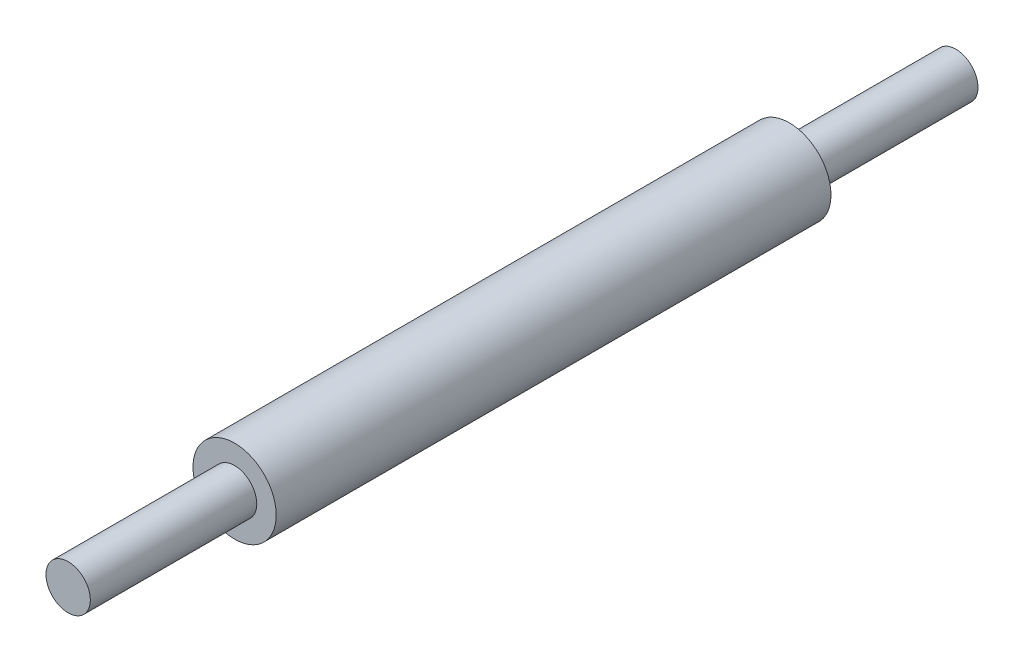
ISO-10303-21;
HEADER;
FILE_DESCRIPTION(('STEP AP214'),'2;1');
FILE_NAME('part.step','',(''),(''),'','','');
FILE_SCHEMA(('AUTOMOTIVE_DESIGN { 1 0 10303 214 1 1 1 1 }'));
ENDSEC;
DATA;
#1=APPLICATION_CONTEXT('core data for automotive mechanical design processes');
#2=APPLICATION_PROTOCOL_DEFINITION('international standard','automotive_design',2000,#1);
#3=PRODUCT_CONTEXT('',#1,'mechanical');
#4=PRODUCT('Part','Part','',(#3));
#5=PRODUCT_RELATED_PRODUCT_CATEGORY('part','',(#4));
#6=PRODUCT_DEFINITION_FORMATION('','',#4);
#7=PRODUCT_DEFINITION_CONTEXT('part definition',#1,'design');
#8=PRODUCT_DEFINITION('design','',#6,#7);
#9=PRODUCT_DEFINITION_SHAPE('','',#8);
#10=(LENGTH_UNIT() NAMED_UNIT(*) SI_UNIT(.MILLI.,.METRE.));
#11=(NAMED_UNIT(*) PLANE_ANGLE_UNIT() SI_UNIT($,.RADIAN.));
#12=(NAMED_UNIT(*) SI_UNIT($,.STERADIAN.) SOLID_ANGLE_UNIT());
#13=UNCERTAINTY_MEASURE_WITH_UNIT(LENGTH_MEASURE(1.E-05),#10,'distance_accuracy_value','');
#14=(GEOMETRIC_REPRESENTATION_CONTEXT(3) GLOBAL_UNCERTAINTY_ASSIGNED_CONTEXT((#13)) GLOBAL_UNIT_ASSIGNED_CONTEXT((#10,
#11,#12)) REPRESENTATION_CONTEXT('',''));
#15=CARTESIAN_POINT('',(0.,0.,0.));
#16=DIRECTION('',(0.,0.,1.));
#17=DIRECTION('',(1.,0.,0.));
#18=AXIS2_PLACEMENT_3D('',#15,#16,#17);
#19=CARTESIAN_POINT('',(0.,0.,10.));
#20=DIRECTION('',(0.,0.,-1.));
#21=DIRECTION('',(-1.,0.,0.));
#22=AXIS2_PLACEMENT_3D('',#19,#20,#21);
#23=CYLINDRICAL_SURFACE('',#22,0.75);
#24=CARTESIAN_POINT('',(0.,0.,10.));
#25=DIRECTION('',(0.,0.,1.));
#26=DIRECTION('',(1.,0.,0.));
#27=AXIS2_PLACEMENT_3D('',#24,#25,#26);
#28=CIRCLE('',#27,0.75);
#29=CARTESIAN_POINT('',(0.75,0.,10.));
#30=VERTEX_POINT('',#29);
#31=EDGE_CURVE('E38',#30,#30,#28,.T.);
#32=ORIENTED_EDGE('',*,*,#31,.F.);
#33=EDGE_LOOP('',(#32));
#34=FACE_BOUND('',#33,.T.);
#35=CARTESIAN_POINT('',(0.,0.,0.));
#36=DIRECTION('',(0.,0.,1.));
#37=DIRECTION('',(1.,0.,0.));
#38=AXIS2_PLACEMENT_3D('',#35,#36,#37);
#39=CIRCLE('',#38,0.75);
#40=CARTESIAN_POINT('',(0.75,0.,0.));
#41=VERTEX_POINT('',#40);
#42=EDGE_CURVE('E42',#41,#41,#39,.T.);
#43=ORIENTED_EDGE('',*,*,#42,.T.);
#44=EDGE_LOOP('',(#43));
#45=FACE_BOUND('',#44,.T.);
#46=ADVANCED_FACE('F32',(#34,#45),#23,.T.);
#47=CARTESIAN_POINT('',(0.,0.,10.));
#48=DIRECTION('',(0.,0.,1.));
#49=DIRECTION('',(1.,0.,0.));
#50=AXIS2_PLACEMENT_3D('',#47,#48,#49);
#51=PLANE('',#50);
#52=CARTESIAN_POINT('',(0.,0.,10.));
#53=DIRECTION('',(0.,0.,1.));
#54=DIRECTION('',(1.,0.,0.));
#55=AXIS2_PLACEMENT_3D('',#52,#53,#54);
#56=CIRCLE('',#55,0.4);
#57=CARTESIAN_POINT('',(0.4,0.,10.));
#58=VERTEX_POINT('',#57);
#59=EDGE_CURVE('E49',#58,#58,#56,.T.);
#60=ORIENTED_EDGE('',*,*,#59,.F.);
#61=EDGE_LOOP('',(#60));
#62=FACE_BOUND('',#61,.T.);
#63=ORIENTED_EDGE('',*,*,#31,.T.);
#64=EDGE_LOOP('',(#63));
#65=FACE_BOUND('',#64,.T.);
#66=ADVANCED_FACE('F73',(#62,#65),#51,.T.);
#67=CARTESIAN_POINT('',(0.,0.,0.));
#68=DIRECTION('',(0.,0.,1.));
#69=DIRECTION('',(1.,0.,0.));
#70=AXIS2_PLACEMENT_3D('',#67,#68,#69);
#71=PLANE('',#70);
#72=CARTESIAN_POINT('',(0.,0.,0.));
#73=DIRECTION('',(0.,0.,1.));
#74=DIRECTION('',(1.,0.,0.));
#75=AXIS2_PLACEMENT_3D('',#72,#73,#74);
#76=CIRCLE('',#75,0.4);
#77=CARTESIAN_POINT('',(0.4,0.,0.));
#78=VERTEX_POINT('',#77);
#79=EDGE_CURVE('E10',#78,#78,#76,.F.);
#80=ORIENTED_EDGE('',*,*,#79,.F.);
#81=EDGE_LOOP('',(#80));
#82=FACE_BOUND('',#81,.T.);
#83=ORIENTED_EDGE('',*,*,#42,.F.);
#84=EDGE_LOOP('',(#83));
#85=FACE_BOUND('',#84,.T.);
#86=ADVANCED_FACE('F78',(#82,#85),#71,.F.);
#87=CARTESIAN_POINT('',(0.,0.,13.));
#88=DIRECTION('',(0.,0.,-1.));
#89=DIRECTION('',(-1.,0.,0.));
#90=AXIS2_PLACEMENT_3D('',#87,#88,#89);
#91=CYLINDRICAL_SURFACE('',#90,0.4);
#92=CARTESIAN_POINT('',(0.,0.,13.));
#93=DIRECTION('',(0.,0.,1.));
#94=DIRECTION('',(1.,0.,0.));
#95=AXIS2_PLACEMENT_3D('',#92,#93,#94);
#96=CIRCLE('',#95,0.4);
#97=CARTESIAN_POINT('',(0.4,0.,13.));
#98=VERTEX_POINT('',#97);
#99=EDGE_CURVE('E47',#98,#98,#96,.T.);
#100=ORIENTED_EDGE('',*,*,#99,.F.);
#101=EDGE_LOOP('',(#100));
#102=FACE_BOUND('',#101,.T.);
#103=ORIENTED_EDGE('',*,*,#59,.T.);
#104=EDGE_LOOP('',(#103));
#105=FACE_BOUND('',#104,.T.);
#106=ADVANCED_FACE('F69',(#102,#105),#91,.T.);
#107=CARTESIAN_POINT('',(0.,0.,13.));
#108=DIRECTION('',(0.,0.,1.));
#109=DIRECTION('',(1.,0.,0.));
#110=AXIS2_PLACEMENT_3D('',#107,#108,#109);
#111=PLANE('',#110);
#112=ORIENTED_EDGE('',*,*,#99,.T.);
#113=EDGE_LOOP('',(#112));
#114=FACE_BOUND('',#113,.T.);
#115=ADVANCED_FACE('F62',(#114),#111,.T.);
#116=CARTESIAN_POINT('',(0.,0.,-3.));
#117=DIRECTION('',(0.,0.,1.));
#118=DIRECTION('',(1.,0.,0.));
#119=AXIS2_PLACEMENT_3D('',#116,#117,#118);
#120=CYLINDRICAL_SURFACE('',#119,0.4);
#121=CARTESIAN_POINT('',(0.,0.,-3.));
#122=DIRECTION('',(0.,0.,-1.));
#123=DIRECTION('',(-1.,0.,0.));
#124=AXIS2_PLACEMENT_3D('',#121,#122,#123);
#125=CIRCLE('',#124,0.4);
#126=CARTESIAN_POINT('',(-0.4,0.,-3.));
#127=VERTEX_POINT('',#126);
#128=EDGE_CURVE('E52',#127,#127,#125,.T.);
#129=ORIENTED_EDGE('',*,*,#128,.F.);
#130=EDGE_LOOP('',(#129));
#131=FACE_BOUND('',#130,.T.);
#132=ORIENTED_EDGE('',*,*,#79,.T.);
#133=EDGE_LOOP('',(#132));
#134=FACE_BOUND('',#133,.T.);
#135=ADVANCED_FACE('F60',(#131,#134),#120,.T.);
#136=CARTESIAN_POINT('',(0.,0.,-3.));
#137=DIRECTION('',(0.,0.,-1.));
#138=DIRECTION('',(-1.,0.,0.));
#139=AXIS2_PLACEMENT_3D('',#136,#137,#138);
#140=PLANE('',#139);
#141=ORIENTED_EDGE('',*,*,#128,.T.);
#142=EDGE_LOOP('',(#141));
#143=FACE_BOUND('',#142,.T.);
#144=ADVANCED_FACE('F58',(#143),#140,.T.);
#145=CLOSED_SHELL('',(#46,#66,#86,#106,#115,#135,#144));
#146=MANIFOLD_SOLID_BREP('B2',#145);
#147=ADVANCED_BREP_SHAPE_REPRESENTATION('',(#18,#146),#14);
#148=SHAPE_DEFINITION_REPRESENTATION(#9,#147);
ENDSEC;
END-ISO-10303-21;
